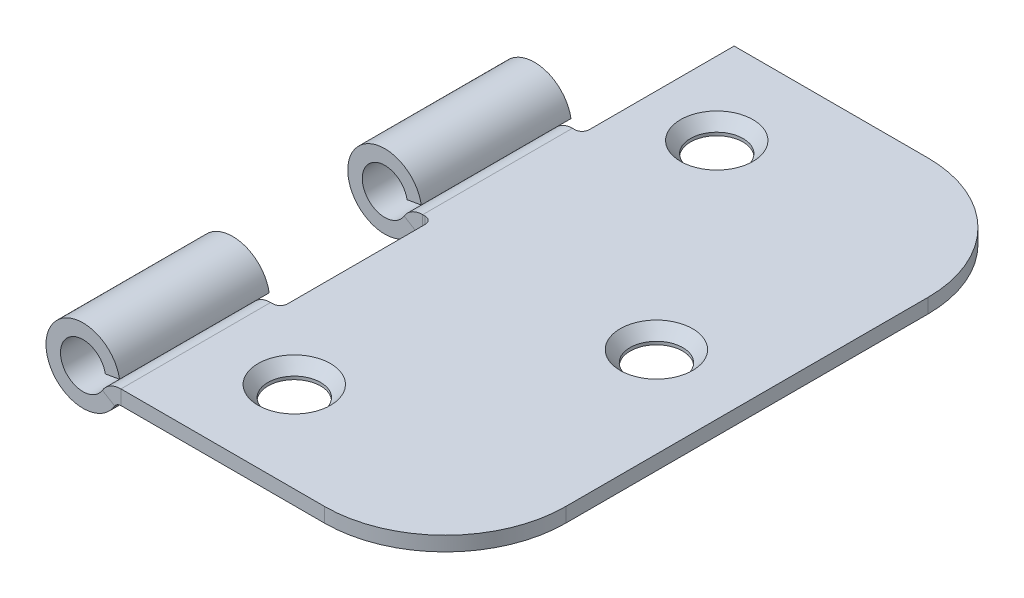
ISO-10303-21;
HEADER;
FILE_DESCRIPTION(('STEP AP214'),'2;1');
FILE_NAME('part.step','',(''),(''),'','','');
FILE_SCHEMA(('AUTOMOTIVE_DESIGN { 1 0 10303 214 1 1 1 1 }'));
ENDSEC;
DATA;
#1=APPLICATION_CONTEXT('core data for automotive mechanical design processes');
#2=APPLICATION_PROTOCOL_DEFINITION('international standard','automotive_design',2000,#1);
#3=PRODUCT_CONTEXT('',#1,'mechanical');
#4=PRODUCT('Part','Part','',(#3));
#5=PRODUCT_RELATED_PRODUCT_CATEGORY('part','',(#4));
#6=PRODUCT_DEFINITION_FORMATION('','',#4);
#7=PRODUCT_DEFINITION_CONTEXT('part definition',#1,'design');
#8=PRODUCT_DEFINITION('design','',#6,#7);
#9=PRODUCT_DEFINITION_SHAPE('','',#8);
#10=(LENGTH_UNIT() NAMED_UNIT(*) SI_UNIT(.MILLI.,.METRE.));
#11=(NAMED_UNIT(*) PLANE_ANGLE_UNIT() SI_UNIT($,.RADIAN.));
#12=(NAMED_UNIT(*) SI_UNIT($,.STERADIAN.) SOLID_ANGLE_UNIT());
#13=UNCERTAINTY_MEASURE_WITH_UNIT(LENGTH_MEASURE(1.E-05),#10,'distance_accuracy_value','');
#14=(GEOMETRIC_REPRESENTATION_CONTEXT(3) GLOBAL_UNCERTAINTY_ASSIGNED_CONTEXT((#13)) GLOBAL_UNIT_ASSIGNED_CONTEXT((#10,
#11,#12)) REPRESENTATION_CONTEXT('',''));
#15=CARTESIAN_POINT('',(0.,0.,0.));
#16=DIRECTION('',(0.,0.,1.));
#17=DIRECTION('',(1.,0.,0.));
#18=AXIS2_PLACEMENT_3D('',#15,#16,#17);
#19=CARTESIAN_POINT('',(-25.4,0.,-53.975));
#20=DIRECTION('',(0.,1.,0.));
#21=DIRECTION('',(0.,0.,1.));
#22=AXIS2_PLACEMENT_3D('',#19,#20,#21);
#23=CYLINDRICAL_SURFACE('',#22,2.7686);
#24=CARTESIAN_POINT('',(-25.4,-1.19799365927996,-53.975));
#25=DIRECTION('',(0.,1.,0.));
#26=DIRECTION('',(0.,0.,1.));
#27=AXIS2_PLACEMENT_3D('',#24,#25,#26);
#28=CIRCLE('',#27,2.7686);
#29=CARTESIAN_POINT('',(-25.4,-1.19799365927996,-51.2064));
#30=VERTEX_POINT('',#29);
#31=EDGE_CURVE('E366',#30,#30,#28,.T.);
#32=ORIENTED_EDGE('',*,*,#31,.T.);
#33=EDGE_LOOP('',(#32));
#34=FACE_BOUND('',#33,.T.);
#35=CARTESIAN_POINT('',(-25.4,-1.524,-53.975));
#36=DIRECTION('',(0.,-1.,0.));
#37=DIRECTION('',(1.,0.,0.));
#38=AXIS2_PLACEMENT_3D('',#35,#36,#37);
#39=CIRCLE('',#38,2.7686);
#40=CARTESIAN_POINT('',(-22.6314,-1.524,-53.975));
#41=VERTEX_POINT('',#40);
#42=EDGE_CURVE('E279',#41,#41,#39,.T.);
#43=ORIENTED_EDGE('',*,*,#42,.T.);
#44=EDGE_LOOP('',(#43));
#45=FACE_BOUND('',#44,.T.);
#46=ADVANCED_FACE('F34',(#34,#45),#23,.F.);
#47=CARTESIAN_POINT('',(-25.4,0.,-53.975));
#48=DIRECTION('',(0.,1.,0.));
#49=DIRECTION('',(0.,0.,1.));
#50=AXIS2_PLACEMENT_3D('',#47,#48,#49);
#51=CONICAL_SURFACE('',#50,3.81,0.715584993317676);
#52=ORIENTED_EDGE('',*,*,#31,.F.);
#53=EDGE_LOOP('',(#52));
#54=FACE_BOUND('',#53,.T.);
#55=CARTESIAN_POINT('',(-25.4,0.,-53.975));
#56=DIRECTION('',(0.,1.,0.));
#57=DIRECTION('',(0.,0.,1.));
#58=AXIS2_PLACEMENT_3D('',#55,#56,#57);
#59=CIRCLE('',#58,3.81);
#60=CARTESIAN_POINT('',(-25.4,0.,-50.165));
#61=VERTEX_POINT('',#60);
#62=EDGE_CURVE('E325',#61,#61,#59,.T.);
#63=ORIENTED_EDGE('',*,*,#62,.T.);
#64=EDGE_LOOP('',(#63));
#65=FACE_BOUND('',#64,.T.);
#66=ADVANCED_FACE('F487',(#54,#65),#51,.F.);
#67=CARTESIAN_POINT('',(-25.4,0.,-9.525));
#68=DIRECTION('',(0.,1.,0.));
#69=DIRECTION('',(0.,0.,1.));
#70=AXIS2_PLACEMENT_3D('',#67,#68,#69);
#71=CYLINDRICAL_SURFACE('',#70,2.7686);
#72=CARTESIAN_POINT('',(-25.4,-1.19799365927996,-9.525));
#73=DIRECTION('',(0.,1.,0.));
#74=DIRECTION('',(0.,0.,1.));
#75=AXIS2_PLACEMENT_3D('',#72,#73,#74);
#76=CIRCLE('',#75,2.7686);
#77=CARTESIAN_POINT('',(-25.4,-1.19799365927996,-6.7564));
#78=VERTEX_POINT('',#77);
#79=EDGE_CURVE('E363',#78,#78,#76,.T.);
#80=ORIENTED_EDGE('',*,*,#79,.T.);
#81=EDGE_LOOP('',(#80));
#82=FACE_BOUND('',#81,.T.);
#83=CARTESIAN_POINT('',(-25.4,-1.524,-9.525));
#84=DIRECTION('',(0.,-1.,0.));
#85=DIRECTION('',(1.,0.,0.));
#86=AXIS2_PLACEMENT_3D('',#83,#84,#85);
#87=CIRCLE('',#86,2.7686);
#88=CARTESIAN_POINT('',(-22.6314,-1.524,-9.525));
#89=VERTEX_POINT('',#88);
#90=EDGE_CURVE('E276',#89,#89,#87,.T.);
#91=ORIENTED_EDGE('',*,*,#90,.T.);
#92=EDGE_LOOP('',(#91));
#93=FACE_BOUND('',#92,.T.);
#94=ADVANCED_FACE('F493',(#82,#93),#71,.F.);
#95=CARTESIAN_POINT('',(-25.4,0.,-9.525));
#96=DIRECTION('',(0.,1.,0.));
#97=DIRECTION('',(0.,0.,1.));
#98=AXIS2_PLACEMENT_3D('',#95,#96,#97);
#99=CONICAL_SURFACE('',#98,3.81,0.715584993317676);
#100=ORIENTED_EDGE('',*,*,#79,.F.);
#101=EDGE_LOOP('',(#100));
#102=FACE_BOUND('',#101,.T.);
#103=CARTESIAN_POINT('',(-25.4,0.,-9.525));
#104=DIRECTION('',(0.,1.,0.));
#105=DIRECTION('',(0.,0.,1.));
#106=AXIS2_PLACEMENT_3D('',#103,#104,#105);
#107=CIRCLE('',#106,3.81);
#108=CARTESIAN_POINT('',(-25.4,0.,-5.715));
#109=VERTEX_POINT('',#108);
#110=EDGE_CURVE('E322',#109,#109,#107,.T.);
#111=ORIENTED_EDGE('',*,*,#110,.T.);
#112=EDGE_LOOP('',(#111));
#113=FACE_BOUND('',#112,.T.);
#114=ADVANCED_FACE('F585',(#102,#113),#99,.F.);
#115=CARTESIAN_POINT('',(-34.1123415630222,0.,-63.5));
#116=DIRECTION('',(0.,1.,0.));
#117=DIRECTION('',(0.,0.,1.));
#118=AXIS2_PLACEMENT_3D('',#115,#116,#117);
#119=PLANE('',#118);
#120=CARTESIAN_POINT('',(-9.525,0.,-31.75));
#121=DIRECTION('',(0.,1.,0.));
#122=DIRECTION('',(0.,0.,1.));
#123=AXIS2_PLACEMENT_3D('',#120,#121,#122);
#124=CIRCLE('',#123,3.81);
#125=CARTESIAN_POINT('',(-9.525,0.,-27.94));
#126=VERTEX_POINT('',#125);
#127=EDGE_CURVE('E319',#126,#126,#124,.T.);
#128=ORIENTED_EDGE('',*,*,#127,.F.);
#129=EDGE_LOOP('',(#128));
#130=FACE_BOUND('',#129,.T.);
#131=ORIENTED_EDGE('',*,*,#110,.F.);
#132=EDGE_LOOP('',(#131));
#133=FACE_BOUND('',#132,.T.);
#134=ORIENTED_EDGE('',*,*,#62,.F.);
#135=EDGE_LOOP('',(#134));
#136=FACE_BOUND('',#135,.T.);
#137=DIRECTION('',(0.,0.,1.));
#138=VECTOR('',#137,1.);
#139=CARTESIAN_POINT('',(0.,0.,-63.5));
#140=LINE('',#139,#138);
#141=CARTESIAN_POINT('',(0.,0.,-50.8));
#142=VERTEX_POINT('',#141);
#143=CARTESIAN_POINT('',(0.,0.,-12.7));
#144=VERTEX_POINT('',#143);
#145=EDGE_CURVE('E349',#142,#144,#140,.T.);
#146=ORIENTED_EDGE('',*,*,#145,.F.);
#147=CARTESIAN_POINT('',(-12.7,0.,-50.8));
#148=DIRECTION('',(0.,1.,0.));
#149=DIRECTION('',(0.,0.,1.));
#150=AXIS2_PLACEMENT_3D('',#147,#148,#149);
#151=CIRCLE('',#150,12.7);
#152=CARTESIAN_POINT('',(-12.7,0.,-63.5));
#153=VERTEX_POINT('',#152);
#154=EDGE_CURVE('E427',#142,#153,#151,.T.);
#155=ORIENTED_EDGE('',*,*,#154,.T.);
#156=DIRECTION('',(-1.,0.,0.));
#157=VECTOR('',#156,1.);
#158=CARTESIAN_POINT('',(-34.1123415630222,0.,-63.5));
#159=LINE('',#158,#157);
#160=CARTESIAN_POINT('',(-33.0963415630222,0.,-63.5));
#161=VERTEX_POINT('',#160);
#162=EDGE_CURVE('E352',#153,#161,#159,.T.);
#163=ORIENTED_EDGE('',*,*,#162,.T.);
#164=DIRECTION('',(0.,0.,-1.));
#165=VECTOR('',#164,1.);
#166=CARTESIAN_POINT('',(-33.0963415630222,0.,-63.5));
#167=LINE('',#166,#165);
#168=CARTESIAN_POINT('',(-33.0963415630222,0.,-48.26));
#169=VERTEX_POINT('',#168);
#170=EDGE_CURVE('E354',#169,#161,#167,.T.);
#171=ORIENTED_EDGE('',*,*,#170,.F.);
#172=CARTESIAN_POINT('',(-33.8583415630222,0.,-48.26));
#173=DIRECTION('',(0.,1.,0.));
#174=DIRECTION('',(0.,0.,1.));
#175=AXIS2_PLACEMENT_3D('',#172,#173,#174);
#176=CIRCLE('',#175,0.762000000000002);
#177=CARTESIAN_POINT('',(-33.8583415630222,0.,-47.498));
#178=VERTEX_POINT('',#177);
#179=EDGE_CURVE('E357',#178,#169,#176,.T.);
#180=ORIENTED_EDGE('',*,*,#179,.F.);
#181=DIRECTION('',(1.,0.,0.));
#182=VECTOR('',#181,1.);
#183=CARTESIAN_POINT('',(-34.1123415630222,0.,-47.498));
#184=LINE('',#183,#182);
#185=CARTESIAN_POINT('',(-34.1123415630222,0.,-47.498));
#186=VERTEX_POINT('',#185);
#187=EDGE_CURVE('E360',#186,#178,#184,.T.);
#188=ORIENTED_EDGE('',*,*,#187,.F.);
#189=DIRECTION('',(0.,0.,1.));
#190=VECTOR('',#189,1.);
#191=CARTESIAN_POINT('',(-34.1123415630222,0.,-63.5));
#192=LINE('',#191,#190);
#193=CARTESIAN_POINT('',(-34.1123415630222,0.,-31.75));
#194=VERTEX_POINT('',#193);
#195=EDGE_CURVE('E347',#186,#194,#192,.T.);
#196=ORIENTED_EDGE('',*,*,#195,.T.);
#197=DIRECTION('',(-1.,0.,0.));
#198=VECTOR('',#197,1.);
#199=CARTESIAN_POINT('',(-34.1123415630222,0.,-31.75));
#200=LINE('',#199,#198);
#201=CARTESIAN_POINT('',(-33.8583415630222,0.,-31.75));
#202=VERTEX_POINT('',#201);
#203=EDGE_CURVE('E328',#202,#194,#200,.T.);
#204=ORIENTED_EDGE('',*,*,#203,.F.);
#205=CARTESIAN_POINT('',(-33.8583415630222,0.,-30.988));
#206=DIRECTION('',(0.,1.,0.));
#207=DIRECTION('',(0.,0.,1.));
#208=AXIS2_PLACEMENT_3D('',#205,#206,#207);
#209=CIRCLE('',#208,0.761999999999995);
#210=CARTESIAN_POINT('',(-33.0963415630222,0.,-30.988));
#211=VERTEX_POINT('',#210);
#212=EDGE_CURVE('E331',#211,#202,#209,.T.);
#213=ORIENTED_EDGE('',*,*,#212,.F.);
#214=DIRECTION('',(0.,0.,-1.));
#215=VECTOR('',#214,1.);
#216=CARTESIAN_POINT('',(-33.0963415630222,0.,-63.5));
#217=LINE('',#216,#215);
#218=CARTESIAN_POINT('',(-33.0963415630222,0.,-16.51));
#219=VERTEX_POINT('',#218);
#220=EDGE_CURVE('E334',#219,#211,#217,.T.);
#221=ORIENTED_EDGE('',*,*,#220,.F.);
#222=CARTESIAN_POINT('',(-33.8583415630222,0.,-16.51));
#223=DIRECTION('',(0.,1.,0.));
#224=DIRECTION('',(0.,0.,1.));
#225=AXIS2_PLACEMENT_3D('',#222,#223,#224);
#226=CIRCLE('',#225,0.762000000000002);
#227=CARTESIAN_POINT('',(-33.8583415630222,0.,-15.748));
#228=VERTEX_POINT('',#227);
#229=EDGE_CURVE('E337',#228,#219,#226,.T.);
#230=ORIENTED_EDGE('',*,*,#229,.F.);
#231=DIRECTION('',(1.,0.,0.));
#232=VECTOR('',#231,1.);
#233=CARTESIAN_POINT('',(-34.1123415630222,0.,-15.748));
#234=LINE('',#233,#232);
#235=CARTESIAN_POINT('',(-34.1123415630222,0.,-15.748));
#236=VERTEX_POINT('',#235);
#237=EDGE_CURVE('E340',#236,#228,#234,.T.);
#238=ORIENTED_EDGE('',*,*,#237,.F.);
#239=CARTESIAN_POINT('',(-34.1123415630222,0.,0.));
#240=VERTEX_POINT('',#239);
#241=EDGE_CURVE('E343',#236,#240,#192,.T.);
#242=ORIENTED_EDGE('',*,*,#241,.T.);
#243=DIRECTION('',(-1.,0.,0.));
#244=VECTOR('',#243,1.);
#245=CARTESIAN_POINT('',(-34.1123415630222,0.,0.));
#246=LINE('',#245,#244);
#247=CARTESIAN_POINT('',(-12.7,0.,0.));
#248=VERTEX_POINT('',#247);
#249=EDGE_CURVE('E346',#248,#240,#246,.T.);
#250=ORIENTED_EDGE('',*,*,#249,.F.);
#251=CARTESIAN_POINT('',(-12.7,0.,-12.7));
#252=DIRECTION('',(0.,1.,0.));
#253=DIRECTION('',(0.,0.,1.));
#254=AXIS2_PLACEMENT_3D('',#251,#252,#253);
#255=CIRCLE('',#254,12.7);
#256=EDGE_CURVE('E425',#248,#144,#255,.T.);
#257=ORIENTED_EDGE('',*,*,#256,.T.);
#258=EDGE_LOOP('',(#146,#155,#163,#171,#180,#188,#196,#204,#213,#221,#230,#238,#242,#250,#257));
#259=FACE_BOUND('',#258,.T.);
#260=ADVANCED_FACE('F441',(#130,#133,#136,#259),#119,.T.);
#261=CARTESIAN_POINT('',(-9.525,0.,-31.75));
#262=DIRECTION('',(0.,1.,0.));
#263=DIRECTION('',(0.,0.,1.));
#264=AXIS2_PLACEMENT_3D('',#261,#262,#263);
#265=CONICAL_SURFACE('',#264,3.81,0.715584993317675);
#266=CARTESIAN_POINT('',(-9.525,-1.19799365927996,-31.75));
#267=DIRECTION('',(0.,1.,0.));
#268=DIRECTION('',(0.,0.,1.));
#269=AXIS2_PLACEMENT_3D('',#266,#267,#268);
#270=CIRCLE('',#269,2.7686);
#271=CARTESIAN_POINT('',(-9.525,-1.19799365927996,-28.9814));
#272=VERTEX_POINT('',#271);
#273=EDGE_CURVE('E316',#272,#272,#270,.T.);
#274=ORIENTED_EDGE('',*,*,#273,.F.);
#275=EDGE_LOOP('',(#274));
#276=FACE_BOUND('',#275,.T.);
#277=ORIENTED_EDGE('',*,*,#127,.T.);
#278=EDGE_LOOP('',(#277));
#279=FACE_BOUND('',#278,.T.);
#280=ADVANCED_FACE('F584',(#276,#279),#265,.F.);
#281=CARTESIAN_POINT('',(-9.525,0.,-31.75));
#282=DIRECTION('',(0.,1.,0.));
#283=DIRECTION('',(0.,0.,1.));
#284=AXIS2_PLACEMENT_3D('',#281,#282,#283);
#285=CYLINDRICAL_SURFACE('',#284,2.7686);
#286=ORIENTED_EDGE('',*,*,#273,.T.);
#287=EDGE_LOOP('',(#286));
#288=FACE_BOUND('',#287,.T.);
#289=CARTESIAN_POINT('',(-9.525,-1.524,-31.75));
#290=DIRECTION('',(0.,-1.,0.));
#291=DIRECTION('',(1.,0.,0.));
#292=AXIS2_PLACEMENT_3D('',#289,#290,#291);
#293=CIRCLE('',#292,2.7686);
#294=CARTESIAN_POINT('',(-6.7564,-1.524,-31.75));
#295=VERTEX_POINT('',#294);
#296=EDGE_CURVE('E269',#295,#295,#293,.T.);
#297=ORIENTED_EDGE('',*,*,#296,.T.);
#298=EDGE_LOOP('',(#297));
#299=FACE_BOUND('',#298,.T.);
#300=ADVANCED_FACE('F598',(#288,#299),#285,.F.);
#301=CARTESIAN_POINT('',(-34.1123415630222,-1.524,-63.5));
#302=DIRECTION('',(0.,-1.,0.));
#303=DIRECTION('',(1.,0.,0.));
#304=AXIS2_PLACEMENT_3D('',#301,#302,#303);
#305=PLANE('',#304);
#306=ORIENTED_EDGE('',*,*,#296,.F.);
#307=EDGE_LOOP('',(#306));
#308=FACE_BOUND('',#307,.T.);
#309=ORIENTED_EDGE('',*,*,#90,.F.);
#310=EDGE_LOOP('',(#309));
#311=FACE_BOUND('',#310,.T.);
#312=ORIENTED_EDGE('',*,*,#42,.F.);
#313=EDGE_LOOP('',(#312));
#314=FACE_BOUND('',#313,.T.);
#315=DIRECTION('',(1.,0.,0.));
#316=VECTOR('',#315,1.);
#317=CARTESIAN_POINT('',(-34.1123415630222,-1.524,-63.5));
#318=LINE('',#317,#316);
#319=CARTESIAN_POINT('',(-33.0963415630222,-1.524,-63.5));
#320=VERTEX_POINT('',#319);
#321=CARTESIAN_POINT('',(-12.7,-1.524,-63.5));
#322=VERTEX_POINT('',#321);
#323=EDGE_CURVE('E298',#320,#322,#318,.T.);
#324=ORIENTED_EDGE('',*,*,#323,.T.);
#325=CARTESIAN_POINT('',(-12.7,-1.524,-50.8));
#326=DIRECTION('',(0.,-1.,0.));
#327=DIRECTION('',(1.,0.,0.));
#328=AXIS2_PLACEMENT_3D('',#325,#326,#327);
#329=CIRCLE('',#328,12.7);
#330=CARTESIAN_POINT('',(0.,-1.524,-50.8));
#331=VERTEX_POINT('',#330);
#332=EDGE_CURVE('E42',#322,#331,#329,.T.);
#333=ORIENTED_EDGE('',*,*,#332,.T.);
#334=DIRECTION('',(0.,0.,1.));
#335=VECTOR('',#334,1.);
#336=CARTESIAN_POINT('',(0.,-1.524,-63.5));
#337=LINE('',#336,#335);
#338=CARTESIAN_POINT('',(0.,-1.524,-12.7));
#339=VERTEX_POINT('',#338);
#340=EDGE_CURVE('E300',#331,#339,#337,.T.);
#341=ORIENTED_EDGE('',*,*,#340,.T.);
#342=CARTESIAN_POINT('',(-12.7,-1.524,-12.7));
#343=DIRECTION('',(0.,-1.,0.));
#344=DIRECTION('',(1.,0.,0.));
#345=AXIS2_PLACEMENT_3D('',#342,#343,#344);
#346=CIRCLE('',#345,12.7);
#347=CARTESIAN_POINT('',(-12.7,-1.524,0.));
#348=VERTEX_POINT('',#347);
#349=EDGE_CURVE('E49',#339,#348,#346,.T.);
#350=ORIENTED_EDGE('',*,*,#349,.T.);
#351=DIRECTION('',(1.,0.,0.));
#352=VECTOR('',#351,1.);
#353=CARTESIAN_POINT('',(-34.1123415630222,-1.524,0.));
#354=LINE('',#353,#352);
#355=CARTESIAN_POINT('',(-34.1123415630222,-1.524,0.));
#356=VERTEX_POINT('',#355);
#357=EDGE_CURVE('E302',#356,#348,#354,.T.);
#358=ORIENTED_EDGE('',*,*,#357,.F.);
#359=DIRECTION('',(0.,0.,1.));
#360=VECTOR('',#359,1.);
#361=CARTESIAN_POINT('',(-34.1123415630222,-1.524,-63.5));
#362=LINE('',#361,#360);
#363=CARTESIAN_POINT('',(-34.1123415630222,-1.524,-15.748));
#364=VERTEX_POINT('',#363);
#365=EDGE_CURVE('E289',#364,#356,#362,.T.);
#366=ORIENTED_EDGE('',*,*,#365,.F.);
#367=DIRECTION('',(-1.,0.,0.));
#368=VECTOR('',#367,1.);
#369=CARTESIAN_POINT('',(-34.1123415630222,-1.524,-15.748));
#370=LINE('',#369,#368);
#371=CARTESIAN_POINT('',(-33.8583415630222,-1.524,-15.748));
#372=VERTEX_POINT('',#371);
#373=EDGE_CURVE('E304',#372,#364,#370,.T.);
#374=ORIENTED_EDGE('',*,*,#373,.F.);
#375=CARTESIAN_POINT('',(-33.8583415630222,-1.524,-16.51));
#376=DIRECTION('',(0.,-1.,0.));
#377=DIRECTION('',(1.,0.,0.));
#378=AXIS2_PLACEMENT_3D('',#375,#376,#377);
#379=CIRCLE('',#378,0.762000000000002);
#380=CARTESIAN_POINT('',(-33.0963415630222,-1.524,-16.51));
#381=VERTEX_POINT('',#380);
#382=EDGE_CURVE('E307',#381,#372,#379,.T.);
#383=ORIENTED_EDGE('',*,*,#382,.F.);
#384=DIRECTION('',(0.,0.,1.));
#385=VECTOR('',#384,1.);
#386=CARTESIAN_POINT('',(-33.0963415630222,-1.524,-63.5));
#387=LINE('',#386,#385);
#388=CARTESIAN_POINT('',(-33.0963415630222,-1.524,-30.988));
#389=VERTEX_POINT('',#388);
#390=EDGE_CURVE('E310',#389,#381,#387,.T.);
#391=ORIENTED_EDGE('',*,*,#390,.F.);
#392=CARTESIAN_POINT('',(-33.8583415630222,-1.524,-30.988));
#393=DIRECTION('',(0.,-1.,0.));
#394=DIRECTION('',(1.,0.,0.));
#395=AXIS2_PLACEMENT_3D('',#392,#393,#394);
#396=CIRCLE('',#395,0.761999999999995);
#397=CARTESIAN_POINT('',(-33.8583415630222,-1.524,-31.75));
#398=VERTEX_POINT('',#397);
#399=EDGE_CURVE('E313',#398,#389,#396,.T.);
#400=ORIENTED_EDGE('',*,*,#399,.F.);
#401=DIRECTION('',(1.,0.,0.));
#402=VECTOR('',#401,1.);
#403=CARTESIAN_POINT('',(-34.1123415630222,-1.524,-31.75));
#404=LINE('',#403,#402);
#405=CARTESIAN_POINT('',(-34.1123415630222,-1.524,-31.75));
#406=VERTEX_POINT('',#405);
#407=EDGE_CURVE('E282',#406,#398,#404,.T.);
#408=ORIENTED_EDGE('',*,*,#407,.F.);
#409=CARTESIAN_POINT('',(-34.1123415630222,-1.524,-47.498));
#410=VERTEX_POINT('',#409);
#411=EDGE_CURVE('E285',#410,#406,#362,.T.);
#412=ORIENTED_EDGE('',*,*,#411,.F.);
#413=DIRECTION('',(-1.,0.,0.));
#414=VECTOR('',#413,1.);
#415=CARTESIAN_POINT('',(-34.1123415630222,-1.524,-47.498));
#416=LINE('',#415,#414);
#417=CARTESIAN_POINT('',(-33.8583415630222,-1.524,-47.498));
#418=VERTEX_POINT('',#417);
#419=EDGE_CURVE('E288',#418,#410,#416,.T.);
#420=ORIENTED_EDGE('',*,*,#419,.F.);
#421=CARTESIAN_POINT('',(-33.8583415630222,-1.524,-48.26));
#422=DIRECTION('',(0.,-1.,0.));
#423=DIRECTION('',(1.,0.,0.));
#424=AXIS2_PLACEMENT_3D('',#421,#422,#423);
#425=CIRCLE('',#424,0.762000000000002);
#426=CARTESIAN_POINT('',(-33.0963415630222,-1.524,-48.26));
#427=VERTEX_POINT('',#426);
#428=EDGE_CURVE('E292',#427,#418,#425,.T.);
#429=ORIENTED_EDGE('',*,*,#428,.F.);
#430=DIRECTION('',(0.,0.,1.));
#431=VECTOR('',#430,1.);
#432=CARTESIAN_POINT('',(-33.0963415630222,-1.524,-63.5));
#433=LINE('',#432,#431);
#434=EDGE_CURVE('E295',#320,#427,#433,.T.);
#435=ORIENTED_EDGE('',*,*,#434,.F.);
#436=EDGE_LOOP('',(#324,#333,#341,#350,#358,#366,#374,#383,#391,#400,#408,#412,#420,#429,#435));
#437=FACE_BOUND('',#436,.T.);
#438=ADVANCED_FACE('F432',(#308,#311,#314,#437),#305,.T.);
#439=CARTESIAN_POINT('',(-34.1123415630222,-144.165208658848,-31.75));
#440=DIRECTION('',(0.,0.,1.));
#441=DIRECTION('',(1.,0.,0.));
#442=AXIS2_PLACEMENT_3D('',#439,#440,#441);
#443=PLANE('',#442);
#444=DIRECTION('',(0.,1.,0.));
#445=VECTOR('',#444,1.);
#446=CARTESIAN_POINT('',(-33.8583415630222,-144.165208658848,-31.75));
#447=LINE('',#446,#445);
#448=EDGE_CURVE('E369',#398,#202,#447,.T.);
#449=ORIENTED_EDGE('',*,*,#448,.T.);
#450=ORIENTED_EDGE('',*,*,#203,.T.);
#451=DIRECTION('',(0.,1.,0.));
#452=VECTOR('',#451,1.);
#453=CARTESIAN_POINT('',(-34.1123415630222,-144.165208658848,-31.75));
#454=LINE('',#453,#452);
#455=EDGE_CURVE('E399',#406,#194,#454,.T.);
#456=ORIENTED_EDGE('',*,*,#455,.F.);
#457=ORIENTED_EDGE('',*,*,#407,.T.);
#458=EDGE_LOOP('',(#449,#450,#456,#457));
#459=FACE_BOUND('',#458,.T.);
#460=ADVANCED_FACE('F457',(#459),#443,.T.);
#461=CARTESIAN_POINT('',(-34.1123415630222,-144.165208658848,-47.498));
#462=DIRECTION('',(0.,0.,-1.));
#463=DIRECTION('',(-1.,0.,0.));
#464=AXIS2_PLACEMENT_3D('',#461,#462,#463);
#465=PLANE('',#464);
#466=DIRECTION('',(0.,1.,0.));
#467=VECTOR('',#466,1.);
#468=CARTESIAN_POINT('',(-34.1123415630222,-144.165208658848,-47.498));
#469=LINE('',#468,#467);
#470=EDGE_CURVE('E396',#410,#186,#469,.T.);
#471=ORIENTED_EDGE('',*,*,#470,.T.);
#472=ORIENTED_EDGE('',*,*,#187,.T.);
#473=DIRECTION('',(0.,1.,0.));
#474=VECTOR('',#473,1.);
#475=CARTESIAN_POINT('',(-33.8583415630222,-144.165208658848,-47.498));
#476=LINE('',#475,#474);
#477=EDGE_CURVE('E393',#418,#178,#476,.T.);
#478=ORIENTED_EDGE('',*,*,#477,.F.);
#479=ORIENTED_EDGE('',*,*,#419,.T.);
#480=EDGE_LOOP('',(#471,#472,#478,#479));
#481=FACE_BOUND('',#480,.T.);
#482=ADVANCED_FACE('F451',(#481),#465,.T.);
#483=CARTESIAN_POINT('',(-33.8583415630222,-144.165208658848,-48.26));
#484=DIRECTION('',(0.,1.,0.));
#485=DIRECTION('',(-1.,0.,0.));
#486=AXIS2_PLACEMENT_3D('',#483,#484,#485);
#487=CYLINDRICAL_SURFACE('',#486,0.762000000000002);
#488=ORIENTED_EDGE('',*,*,#477,.T.);
#489=ORIENTED_EDGE('',*,*,#179,.T.);
#490=DIRECTION('',(0.,1.,0.));
#491=VECTOR('',#490,1.);
#492=CARTESIAN_POINT('',(-33.0963415630222,-144.165208658848,-48.26));
#493=LINE('',#492,#491);
#494=EDGE_CURVE('E390',#427,#169,#493,.T.);
#495=ORIENTED_EDGE('',*,*,#494,.F.);
#496=ORIENTED_EDGE('',*,*,#428,.T.);
#497=EDGE_LOOP('',(#488,#489,#495,#496));
#498=FACE_BOUND('',#497,.T.);
#499=ADVANCED_FACE('F448',(#498),#487,.F.);
#500=CARTESIAN_POINT('',(-33.0963415630222,-144.165208658848,-63.5));
#501=DIRECTION('',(-1.,0.,0.));
#502=DIRECTION('',(0.,-1.,0.));
#503=AXIS2_PLACEMENT_3D('',#500,#501,#502);
#504=PLANE('',#503);
#505=ORIENTED_EDGE('',*,*,#494,.T.);
#506=ORIENTED_EDGE('',*,*,#170,.T.);
#507=DIRECTION('',(0.,1.,0.));
#508=VECTOR('',#507,1.);
#509=CARTESIAN_POINT('',(-33.0963415630222,-144.165208658848,-63.5));
#510=LINE('',#509,#508);
#511=EDGE_CURVE('E387',#320,#161,#510,.T.);
#512=ORIENTED_EDGE('',*,*,#511,.F.);
#513=ORIENTED_EDGE('',*,*,#434,.T.);
#514=EDGE_LOOP('',(#505,#506,#512,#513));
#515=FACE_BOUND('',#514,.T.);
#516=ADVANCED_FACE('F445',(#515),#504,.T.);
#517=CARTESIAN_POINT('',(-34.1123415630222,-144.165208658848,-63.5));
#518=DIRECTION('',(0.,0.,1.));
#519=DIRECTION('',(1.,0.,0.));
#520=AXIS2_PLACEMENT_3D('',#517,#518,#519);
#521=PLANE('',#520);
#522=ORIENTED_EDGE('',*,*,#162,.F.);
#523=DIRECTION('',(0.,1.,0.));
#524=VECTOR('',#523,1.);
#525=CARTESIAN_POINT('',(-12.7,-144.165208658848,-63.5));
#526=LINE('',#525,#524);
#527=EDGE_CURVE('E57',#153,#322,#526,.F.);
#528=ORIENTED_EDGE('',*,*,#527,.T.);
#529=ORIENTED_EDGE('',*,*,#323,.F.);
#530=ORIENTED_EDGE('',*,*,#511,.T.);
#531=EDGE_LOOP('',(#522,#528,#529,#530));
#532=FACE_BOUND('',#531,.T.);
#533=ADVANCED_FACE('F442',(#532),#521,.F.);
#534=CARTESIAN_POINT('',(0.,-144.165208658848,-63.5));
#535=DIRECTION('',(-1.,0.,0.));
#536=DIRECTION('',(0.,-1.,0.));
#537=AXIS2_PLACEMENT_3D('',#534,#535,#536);
#538=PLANE('',#537);
#539=ORIENTED_EDGE('',*,*,#340,.F.);
#540=DIRECTION('',(0.,1.,0.));
#541=VECTOR('',#540,1.);
#542=CARTESIAN_POINT('',(0.,-144.165208658848,-50.8));
#543=LINE('',#542,#541);
#544=EDGE_CURVE('E422',#331,#142,#543,.T.);
#545=ORIENTED_EDGE('',*,*,#544,.T.);
#546=ORIENTED_EDGE('',*,*,#145,.T.);
#547=DIRECTION('',(0.,1.,0.));
#548=VECTOR('',#547,1.);
#549=CARTESIAN_POINT('',(0.,-1.524,-12.7));
#550=LINE('',#549,#548);
#551=EDGE_CURVE('E414',#144,#339,#550,.F.);
#552=ORIENTED_EDGE('',*,*,#551,.T.);
#553=EDGE_LOOP('',(#539,#545,#546,#552));
#554=FACE_BOUND('',#553,.T.);
#555=ADVANCED_FACE('F436',(#554),#538,.F.);
#556=CARTESIAN_POINT('',(-34.1123415630222,-144.165208658848,0.));
#557=DIRECTION('',(0.,0.,1.));
#558=DIRECTION('',(1.,0.,0.));
#559=AXIS2_PLACEMENT_3D('',#556,#557,#558);
#560=PLANE('',#559);
#561=ORIENTED_EDGE('',*,*,#357,.T.);
#562=DIRECTION('',(0.,1.,0.));
#563=VECTOR('',#562,1.);
#564=CARTESIAN_POINT('',(-12.7,0.,0.));
#565=LINE('',#564,#563);
#566=EDGE_CURVE('E11',#348,#248,#565,.T.);
#567=ORIENTED_EDGE('',*,*,#566,.T.);
#568=ORIENTED_EDGE('',*,*,#249,.T.);
#569=DIRECTION('',(0.,1.,0.));
#570=VECTOR('',#569,1.);
#571=CARTESIAN_POINT('',(-34.1123415630222,-144.165208658848,0.));
#572=LINE('',#571,#570);
#573=EDGE_CURVE('E384',#356,#240,#572,.T.);
#574=ORIENTED_EDGE('',*,*,#573,.F.);
#575=EDGE_LOOP('',(#561,#567,#568,#574));
#576=FACE_BOUND('',#575,.T.);
#577=ADVANCED_FACE('F515',(#576),#560,.T.);
#578=CARTESIAN_POINT('',(-34.1123415630222,-144.165208658848,-15.748));
#579=DIRECTION('',(0.,0.,-1.));
#580=DIRECTION('',(-1.,0.,0.));
#581=AXIS2_PLACEMENT_3D('',#578,#579,#580);
#582=PLANE('',#581);
#583=DIRECTION('',(0.,1.,0.));
#584=VECTOR('',#583,1.);
#585=CARTESIAN_POINT('',(-34.1123415630222,-144.165208658848,-15.748));
#586=LINE('',#585,#584);
#587=EDGE_CURVE('E381',#364,#236,#586,.T.);
#588=ORIENTED_EDGE('',*,*,#587,.T.);
#589=ORIENTED_EDGE('',*,*,#237,.T.);
#590=DIRECTION('',(0.,1.,0.));
#591=VECTOR('',#590,1.);
#592=CARTESIAN_POINT('',(-33.8583415630222,-144.165208658848,-15.748));
#593=LINE('',#592,#591);
#594=EDGE_CURVE('E378',#372,#228,#593,.T.);
#595=ORIENTED_EDGE('',*,*,#594,.F.);
#596=ORIENTED_EDGE('',*,*,#373,.T.);
#597=EDGE_LOOP('',(#588,#589,#595,#596));
#598=FACE_BOUND('',#597,.T.);
#599=ADVANCED_FACE('F511',(#598),#582,.T.);
#600=CARTESIAN_POINT('',(-33.8583415630222,-144.165208658848,-16.51));
#601=DIRECTION('',(0.,1.,0.));
#602=DIRECTION('',(-1.,0.,0.));
#603=AXIS2_PLACEMENT_3D('',#600,#601,#602);
#604=CYLINDRICAL_SURFACE('',#603,0.762000000000002);
#605=ORIENTED_EDGE('',*,*,#594,.T.);
#606=ORIENTED_EDGE('',*,*,#229,.T.);
#607=DIRECTION('',(0.,1.,0.));
#608=VECTOR('',#607,1.);
#609=CARTESIAN_POINT('',(-33.0963415630222,-144.165208658848,-16.51));
#610=LINE('',#609,#608);
#611=EDGE_CURVE('E375',#381,#219,#610,.T.);
#612=ORIENTED_EDGE('',*,*,#611,.F.);
#613=ORIENTED_EDGE('',*,*,#382,.T.);
#614=EDGE_LOOP('',(#605,#606,#612,#613));
#615=FACE_BOUND('',#614,.T.);
#616=ADVANCED_FACE('F507',(#615),#604,.F.);
#617=CARTESIAN_POINT('',(-33.0963415630222,-144.165208658848,-63.5));
#618=DIRECTION('',(-1.,0.,0.));
#619=DIRECTION('',(0.,0.,1.));
#620=AXIS2_PLACEMENT_3D('',#617,#618,#619);
#621=PLANE('',#620);
#622=ORIENTED_EDGE('',*,*,#611,.T.);
#623=ORIENTED_EDGE('',*,*,#220,.T.);
#624=DIRECTION('',(0.,1.,0.));
#625=VECTOR('',#624,1.);
#626=CARTESIAN_POINT('',(-33.0963415630222,-144.165208658848,-30.988));
#627=LINE('',#626,#625);
#628=EDGE_CURVE('E372',#389,#211,#627,.T.);
#629=ORIENTED_EDGE('',*,*,#628,.F.);
#630=ORIENTED_EDGE('',*,*,#390,.T.);
#631=EDGE_LOOP('',(#622,#623,#629,#630));
#632=FACE_BOUND('',#631,.T.);
#633=ADVANCED_FACE('F503',(#632),#621,.T.);
#634=CARTESIAN_POINT('',(-33.8583415630222,-144.165208658848,-30.988));
#635=DIRECTION('',(0.,1.,0.));
#636=DIRECTION('',(-1.,0.,0.));
#637=AXIS2_PLACEMENT_3D('',#634,#635,#636);
#638=CYLINDRICAL_SURFACE('',#637,0.761999999999995);
#639=ORIENTED_EDGE('',*,*,#628,.T.);
#640=ORIENTED_EDGE('',*,*,#212,.T.);
#641=ORIENTED_EDGE('',*,*,#448,.F.);
#642=ORIENTED_EDGE('',*,*,#399,.T.);
#643=EDGE_LOOP('',(#639,#640,#641,#642));
#644=FACE_BOUND('',#643,.T.);
#645=ADVANCED_FACE('F499',(#644),#638,.F.);
#646=CARTESIAN_POINT('',(-34.1123415630222,-2.28599999999999,0.));
#647=DIRECTION('',(0.,0.,1.));
#648=DIRECTION('',(1.,0.,0.));
#649=AXIS2_PLACEMENT_3D('',#646,#647,#648);
#650=PLANE('',#649);
#651=DIRECTION('',(-0.855555458597648,0.517711171662124,0.));
#652=VECTOR('',#651,1.);
#653=CARTESIAN_POINT('',(-34.7642748224736,-1.89150408719345,0.));
#654=LINE('',#653,#652);
#655=CARTESIAN_POINT('',(-34.7642748224736,-1.89150408719344,0.));
#656=VERTEX_POINT('',#655);
#657=CARTESIAN_POINT('',(-36.0681413413765,-1.10251226158037,0.));
#658=VERTEX_POINT('',#657);
#659=EDGE_CURVE('E406',#656,#658,#654,.T.);
#660=ORIENTED_EDGE('',*,*,#659,.F.);
#661=CARTESIAN_POINT('',(-34.1123415630222,-2.28599999999999,0.));
#662=DIRECTION('',(0.,0.,-1.));
#663=DIRECTION('',(0.,1.,0.));
#664=AXIS2_PLACEMENT_3D('',#661,#662,#663);
#665=CIRCLE('',#664,0.761999999999995);
#666=EDGE_CURVE('E261',#656,#356,#665,.T.);
#667=ORIENTED_EDGE('',*,*,#666,.T.);
#668=ORIENTED_EDGE('',*,*,#573,.T.);
#669=CARTESIAN_POINT('',(-34.1123415630222,-2.28599999999999,0.));
#670=DIRECTION('',(0.,0.,-1.));
#671=DIRECTION('',(0.,1.,0.));
#672=AXIS2_PLACEMENT_3D('',#669,#670,#671);
#673=CIRCLE('',#672,2.286);
#674=EDGE_CURVE('E262',#658,#240,#673,.T.);
#675=ORIENTED_EDGE('',*,*,#674,.F.);
#676=EDGE_LOOP('',(#660,#667,#668,#675));
#677=FACE_BOUND('',#676,.T.);
#678=ADVANCED_FACE('F502',(#677),#650,.T.);
#679=CARTESIAN_POINT('',(-34.1123415630222,-2.286,-15.748));
#680=DIRECTION('',(0.,0.,-1.));
#681=DIRECTION('',(0.,1.,0.));
#682=AXIS2_PLACEMENT_3D('',#679,#680,#681);
#683=PLANE('',#682);
#684=CARTESIAN_POINT('',(-34.1123415630222,-2.286,-15.748));
#685=DIRECTION('',(0.,0.,-1.));
#686=DIRECTION('',(0.,1.,0.));
#687=AXIS2_PLACEMENT_3D('',#684,#685,#686);
#688=CIRCLE('',#687,0.761999999999995);
#689=CARTESIAN_POINT('',(-34.7642748224737,-1.89150408719346,-15.748));
#690=VERTEX_POINT('',#689);
#691=EDGE_CURVE('E266',#364,#690,#688,.F.);
#692=ORIENTED_EDGE('',*,*,#691,.T.);
#693=DIRECTION('',(-0.855555458597648,0.517711171662124,0.));
#694=VECTOR('',#693,1.);
#695=CARTESIAN_POINT('',(-34.7642748224737,-1.89150408719346,-15.748));
#696=LINE('',#695,#694);
#697=CARTESIAN_POINT('',(-36.0681413413765,-1.10251226158038,-15.748));
#698=VERTEX_POINT('',#697);
#699=EDGE_CURVE('E402',#690,#698,#696,.T.);
#700=ORIENTED_EDGE('',*,*,#699,.T.);
#701=CARTESIAN_POINT('',(-34.1123415630222,-2.286,-15.748));
#702=DIRECTION('',(0.,0.,-1.));
#703=DIRECTION('',(0.,1.,0.));
#704=AXIS2_PLACEMENT_3D('',#701,#702,#703);
#705=CIRCLE('',#704,2.286);
#706=EDGE_CURVE('E265',#236,#698,#705,.F.);
#707=ORIENTED_EDGE('',*,*,#706,.F.);
#708=ORIENTED_EDGE('',*,*,#587,.F.);
#709=EDGE_LOOP('',(#692,#700,#707,#708));
#710=FACE_BOUND('',#709,.T.);
#711=ADVANCED_FACE('F654',(#710),#683,.T.);
#712=CARTESIAN_POINT('',(-34.1123415630222,-2.28599999999996,82.2973196010219));
#713=DIRECTION('',(0.,0.,-1.));
#714=DIRECTION('',(0.,1.,0.));
#715=AXIS2_PLACEMENT_3D('',#712,#713,#714);
#716=CYLINDRICAL_SURFACE('',#715,2.286);
#717=ORIENTED_EDGE('',*,*,#241,.F.);
#718=ORIENTED_EDGE('',*,*,#706,.T.);
#719=DIRECTION('',(0.,0.,1.));
#720=VECTOR('',#719,1.);
#721=CARTESIAN_POINT('',(-36.0681413413765,-1.10251226158038,-15.748));
#722=LINE('',#721,#720);
#723=EDGE_CURVE('E409',#698,#658,#722,.T.);
#724=ORIENTED_EDGE('',*,*,#723,.T.);
#725=ORIENTED_EDGE('',*,*,#674,.T.);
#726=EDGE_LOOP('',(#717,#718,#724,#725));
#727=FACE_BOUND('',#726,.T.);
#728=ADVANCED_FACE('F662',(#727),#716,.T.);
#729=CARTESIAN_POINT('',(-34.1123415630222,-2.28599999999996,82.2973196010219));
#730=DIRECTION('',(0.,0.,-1.));
#731=DIRECTION('',(0.,1.,0.));
#732=AXIS2_PLACEMENT_3D('',#729,#730,#731);
#733=CYLINDRICAL_SURFACE('',#732,0.761999999999995);
#734=ORIENTED_EDGE('',*,*,#365,.T.);
#735=ORIENTED_EDGE('',*,*,#666,.F.);
#736=DIRECTION('',(0.,0.,1.));
#737=VECTOR('',#736,1.);
#738=CARTESIAN_POINT('',(-34.7642748224737,-1.89150408719346,-15.748));
#739=LINE('',#738,#737);
#740=EDGE_CURVE('E403',#690,#656,#739,.T.);
#741=ORIENTED_EDGE('',*,*,#740,.F.);
#742=ORIENTED_EDGE('',*,*,#691,.F.);
#743=EDGE_LOOP('',(#734,#735,#741,#742));
#744=FACE_BOUND('',#743,.T.);
#745=ADVANCED_FACE('F670',(#744),#733,.F.);
#746=CARTESIAN_POINT('',(-38.1,0.127,0.));
#747=DIRECTION('',(0.,0.,1.));
#748=DIRECTION('',(0.,-1.,0.));
#749=AXIS2_PLACEMENT_3D('',#746,#747,#748);
#750=PLANE('',#749);
#751=ORIENTED_EDGE('',*,*,#659,.T.);
#752=CARTESIAN_POINT('',(-38.1,0.127,0.));
#753=DIRECTION('',(0.,0.,1.));
#754=DIRECTION('',(1.,0.,0.));
#755=AXIS2_PLACEMENT_3D('',#752,#753,#754);
#756=CIRCLE('',#755,2.3749);
#757=CARTESIAN_POINT('',(-35.7611800673713,0.53939705714116,0.));
#758=VERTEX_POINT('',#757);
#759=EDGE_CURVE('E244',#658,#758,#756,.F.);
#760=ORIENTED_EDGE('',*,*,#759,.T.);
#761=DIRECTION('',(0.98480775301221,0.173648177666917,0.));
#762=VECTOR('',#761,1.);
#763=CARTESIAN_POINT('',(-35.1308243208233,0.650545782702201,0.));
#764=LINE('',#763,#762);
#765=CARTESIAN_POINT('',(-34.2603330517807,0.804036879905541,0.));
#766=VERTEX_POINT('',#765);
#767=EDGE_CURVE('E259',#758,#766,#764,.T.);
#768=ORIENTED_EDGE('',*,*,#767,.T.);
#769=CARTESIAN_POINT('',(-38.1,0.127,0.));
#770=DIRECTION('',(0.,0.,1.));
#771=DIRECTION('',(1.,0.,0.));
#772=AXIS2_PLACEMENT_3D('',#769,#770,#771);
#773=CIRCLE('',#772,3.8989);
#774=EDGE_CURVE('E247',#656,#766,#773,.F.);
#775=ORIENTED_EDGE('',*,*,#774,.F.);
#776=EDGE_LOOP('',(#751,#760,#768,#775));
#777=FACE_BOUND('',#776,.T.);
#778=ADVANCED_FACE('F678',(#777),#750,.T.);
#779=CARTESIAN_POINT('',(-35.1308243208233,0.650545782702206,-7.874));
#780=DIRECTION('',(0.173648177666919,-0.98480775301221,0.));
#781=DIRECTION('',(0.,0.,-1.));
#782=AXIS2_PLACEMENT_3D('',#779,#780,#781);
#783=PLANE('',#782);
#784=ORIENTED_EDGE('',*,*,#767,.F.);
#785=DIRECTION('',(0.,0.,1.));
#786=VECTOR('',#785,1.);
#787=CARTESIAN_POINT('',(-35.7611800673713,0.539397057141165,-99.619482803377));
#788=LINE('',#787,#786);
#789=CARTESIAN_POINT('',(-35.7611800673713,0.539397057141168,-15.748));
#790=VERTEX_POINT('',#789);
#791=EDGE_CURVE('E253',#758,#790,#788,.F.);
#792=ORIENTED_EDGE('',*,*,#791,.T.);
#793=DIRECTION('',(0.98480775301221,0.17364817766692,0.));
#794=VECTOR('',#793,1.);
#795=CARTESIAN_POINT('',(-35.1308243208233,0.65054578270221,-15.748));
#796=LINE('',#795,#794);
#797=CARTESIAN_POINT('',(-34.2603330517807,0.804036879905554,-15.748));
#798=VERTEX_POINT('',#797);
#799=EDGE_CURVE('E250',#790,#798,#796,.T.);
#800=ORIENTED_EDGE('',*,*,#799,.T.);
#801=DIRECTION('',(0.,0.,1.));
#802=VECTOR('',#801,1.);
#803=CARTESIAN_POINT('',(-34.2603330517807,0.804036879905549,-99.619482803377));
#804=LINE('',#803,#802);
#805=EDGE_CURVE('E243',#766,#798,#804,.F.);
#806=ORIENTED_EDGE('',*,*,#805,.F.);
#807=EDGE_LOOP('',(#784,#792,#800,#806));
#808=FACE_BOUND('',#807,.T.);
#809=ADVANCED_FACE('F686',(#808),#783,.T.);
#810=CARTESIAN_POINT('',(-38.1,0.127,-15.748));
#811=DIRECTION('',(0.,0.,-1.));
#812=DIRECTION('',(0.,1.,0.));
#813=AXIS2_PLACEMENT_3D('',#810,#811,#812);
#814=PLANE('',#813);
#815=ORIENTED_EDGE('',*,*,#799,.F.);
#816=CARTESIAN_POINT('',(-38.1,0.127,-15.748));
#817=DIRECTION('',(0.,0.,1.));
#818=DIRECTION('',(1.,0.,0.));
#819=AXIS2_PLACEMENT_3D('',#816,#817,#818);
#820=CIRCLE('',#819,2.3749);
#821=EDGE_CURVE('E235',#790,#698,#820,.T.);
#822=ORIENTED_EDGE('',*,*,#821,.T.);
#823=ORIENTED_EDGE('',*,*,#699,.F.);
#824=CARTESIAN_POINT('',(-38.1,0.127,-15.748));
#825=DIRECTION('',(0.,0.,1.));
#826=DIRECTION('',(1.,0.,0.));
#827=AXIS2_PLACEMENT_3D('',#824,#825,#826);
#828=CIRCLE('',#827,3.8989);
#829=EDGE_CURVE('E240',#798,#690,#828,.T.);
#830=ORIENTED_EDGE('',*,*,#829,.F.);
#831=EDGE_LOOP('',(#815,#822,#823,#830));
#832=FACE_BOUND('',#831,.T.);
#833=ADVANCED_FACE('F694',(#832),#814,.T.);
#834=CARTESIAN_POINT('',(-38.1,0.127,-99.619482803377));
#835=DIRECTION('',(0.,0.,1.));
#836=DIRECTION('',(1.,0.,0.));
#837=AXIS2_PLACEMENT_3D('',#834,#835,#836);
#838=CYLINDRICAL_SURFACE('',#837,3.8989);
#839=ORIENTED_EDGE('',*,*,#829,.T.);
#840=ORIENTED_EDGE('',*,*,#740,.T.);
#841=ORIENTED_EDGE('',*,*,#774,.T.);
#842=ORIENTED_EDGE('',*,*,#805,.T.);
#843=EDGE_LOOP('',(#839,#840,#841,#842));
#844=FACE_BOUND('',#843,.T.);
#845=ADVANCED_FACE('F702',(#844),#838,.T.);
#846=CARTESIAN_POINT('',(-38.1,0.127,-99.619482803377));
#847=DIRECTION('',(0.,0.,1.));
#848=DIRECTION('',(1.,0.,0.));
#849=AXIS2_PLACEMENT_3D('',#846,#847,#848);
#850=CYLINDRICAL_SURFACE('',#849,2.3749);
#851=ORIENTED_EDGE('',*,*,#821,.F.);
#852=ORIENTED_EDGE('',*,*,#791,.F.);
#853=ORIENTED_EDGE('',*,*,#759,.F.);
#854=ORIENTED_EDGE('',*,*,#723,.F.);
#855=EDGE_LOOP('',(#851,#852,#853,#854));
#856=FACE_BOUND('',#855,.T.);
#857=ADVANCED_FACE('F483',(#856),#850,.F.);
#858=CARTESIAN_POINT('',(-34.1123415630222,-2.286,-31.75));
#859=DIRECTION('',(0.,0.,1.));
#860=DIRECTION('',(0.,-1.,0.));
#861=AXIS2_PLACEMENT_3D('',#858,#859,#860);
#862=PLANE('',#861);
#863=DIRECTION('',(-0.855555458597648,0.517711171662123,0.));
#864=VECTOR('',#863,1.);
#865=CARTESIAN_POINT('',(-34.7642748224737,-1.89150408719347,-31.75));
#866=LINE('',#865,#864);
#867=CARTESIAN_POINT('',(-34.7642748224737,-1.89150408719346,-31.75));
#868=VERTEX_POINT('',#867);
#869=CARTESIAN_POINT('',(-36.0681413413765,-1.10251226158039,-31.75));
#870=VERTEX_POINT('',#869);
#871=EDGE_CURVE('E415',#868,#870,#866,.T.);
#872=ORIENTED_EDGE('',*,*,#871,.F.);
#873=CARTESIAN_POINT('',(-34.1123415630222,-2.286,-31.75));
#874=DIRECTION('',(0.,0.,-1.));
#875=DIRECTION('',(-1.,0.,0.));
#876=AXIS2_PLACEMENT_3D('',#873,#874,#875);
#877=CIRCLE('',#876,0.761999999999999);
#878=EDGE_CURVE('E227',#868,#406,#877,.T.);
#879=ORIENTED_EDGE('',*,*,#878,.T.);
#880=ORIENTED_EDGE('',*,*,#455,.T.);
#881=CARTESIAN_POINT('',(-34.1123415630222,-2.286,-31.75));
#882=DIRECTION('',(0.,0.,-1.));
#883=DIRECTION('',(-1.,0.,0.));
#884=AXIS2_PLACEMENT_3D('',#881,#882,#883);
#885=CIRCLE('',#884,2.286);
#886=EDGE_CURVE('E228',#870,#194,#885,.T.);
#887=ORIENTED_EDGE('',*,*,#886,.F.);
#888=EDGE_LOOP('',(#872,#879,#880,#887));
#889=FACE_BOUND('',#888,.T.);
#890=ADVANCED_FACE('F463',(#889),#862,.T.);
#891=CARTESIAN_POINT('',(-34.1123415630222,-2.28600000000001,-47.498));
#892=DIRECTION('',(0.,0.,-1.));
#893=DIRECTION('',(0.,1.,0.));
#894=AXIS2_PLACEMENT_3D('',#891,#892,#893);
#895=PLANE('',#894);
#896=CARTESIAN_POINT('',(-34.1123415630222,-2.28600000000001,-47.498));
#897=DIRECTION('',(0.,0.,-1.));
#898=DIRECTION('',(-1.,0.,0.));
#899=AXIS2_PLACEMENT_3D('',#896,#897,#898);
#900=CIRCLE('',#899,0.761999999999999);
#901=CARTESIAN_POINT('',(-34.7642748224736,-1.89150408719346,-47.498));
#902=VERTEX_POINT('',#901);
#903=EDGE_CURVE('E232',#410,#902,#900,.F.);
#904=ORIENTED_EDGE('',*,*,#903,.T.);
#905=DIRECTION('',(-0.855555458597648,0.517711171662123,0.));
#906=VECTOR('',#905,1.);
#907=CARTESIAN_POINT('',(-34.7642748224736,-1.89150408719346,-47.498));
#908=LINE('',#907,#906);
#909=CARTESIAN_POINT('',(-36.0681413413765,-1.10251226158039,-47.498));
#910=VERTEX_POINT('',#909);
#911=EDGE_CURVE('E216',#902,#910,#908,.T.);
#912=ORIENTED_EDGE('',*,*,#911,.T.);
#913=CARTESIAN_POINT('',(-34.1123415630222,-2.28600000000001,-47.498));
#914=DIRECTION('',(0.,0.,-1.));
#915=DIRECTION('',(-1.,0.,0.));
#916=AXIS2_PLACEMENT_3D('',#913,#914,#915);
#917=CIRCLE('',#916,2.286);
#918=EDGE_CURVE('E231',#186,#910,#917,.F.);
#919=ORIENTED_EDGE('',*,*,#918,.F.);
#920=ORIENTED_EDGE('',*,*,#470,.F.);
#921=EDGE_LOOP('',(#904,#912,#919,#920));
#922=FACE_BOUND('',#921,.T.);
#923=ADVANCED_FACE('F475',(#922),#895,.T.);
#924=CARTESIAN_POINT('',(-34.1123415630223,-2.28599999999998,50.9018718623647));
#925=DIRECTION('',(0.,0.,-1.));
#926=DIRECTION('',(-1.,0.,0.));
#927=AXIS2_PLACEMENT_3D('',#924,#925,#926);
#928=CYLINDRICAL_SURFACE('',#927,2.286);
#929=ORIENTED_EDGE('',*,*,#195,.F.);
#930=ORIENTED_EDGE('',*,*,#918,.T.);
#931=DIRECTION('',(0.,0.,1.));
#932=VECTOR('',#931,1.);
#933=CARTESIAN_POINT('',(-36.0681413413765,-1.10251226158039,-47.498));
#934=LINE('',#933,#932);
#935=EDGE_CURVE('E418',#910,#870,#934,.T.);
#936=ORIENTED_EDGE('',*,*,#935,.T.);
#937=ORIENTED_EDGE('',*,*,#886,.T.);
#938=EDGE_LOOP('',(#929,#930,#936,#937));
#939=FACE_BOUND('',#938,.T.);
#940=ADVANCED_FACE('F464',(#939),#928,.T.);
#941=CARTESIAN_POINT('',(-34.1123415630223,-2.28599999999998,50.9018718623647));
#942=DIRECTION('',(0.,0.,-1.));
#943=DIRECTION('',(-1.,0.,0.));
#944=AXIS2_PLACEMENT_3D('',#941,#942,#943);
#945=CYLINDRICAL_SURFACE('',#944,0.761999999999999);
#946=ORIENTED_EDGE('',*,*,#411,.T.);
#947=ORIENTED_EDGE('',*,*,#878,.F.);
#948=DIRECTION('',(0.,0.,1.));
#949=VECTOR('',#948,1.);
#950=CARTESIAN_POINT('',(-34.7642748224736,-1.89150408719346,-47.498));
#951=LINE('',#950,#949);
#952=EDGE_CURVE('E412',#902,#868,#951,.T.);
#953=ORIENTED_EDGE('',*,*,#952,.F.);
#954=ORIENTED_EDGE('',*,*,#903,.F.);
#955=EDGE_LOOP('',(#946,#947,#953,#954));
#956=FACE_BOUND('',#955,.T.);
#957=ADVANCED_FACE('F473',(#956),#945,.F.);
#958=CARTESIAN_POINT('',(-38.1,0.126999999999996,-31.75));
#959=DIRECTION('',(0.,0.,1.));
#960=DIRECTION('',(0.,-1.,0.));
#961=AXIS2_PLACEMENT_3D('',#958,#959,#960);
#962=PLANE('',#961);
#963=ORIENTED_EDGE('',*,*,#871,.T.);
#964=CARTESIAN_POINT('',(-38.1,0.126999999999996,-31.75));
#965=DIRECTION('',(0.,0.,1.));
#966=DIRECTION('',(1.,0.,0.));
#967=AXIS2_PLACEMENT_3D('',#964,#965,#966);
#968=CIRCLE('',#967,2.3749);
#969=CARTESIAN_POINT('',(-35.7611800673713,0.53939705714116,-31.75));
#970=VERTEX_POINT('',#969);
#971=EDGE_CURVE('E217',#870,#970,#968,.F.);
#972=ORIENTED_EDGE('',*,*,#971,.T.);
#973=DIRECTION('',(0.98480775301221,0.173648177666918,0.));
#974=VECTOR('',#973,1.);
#975=CARTESIAN_POINT('',(-35.1308243208233,0.650545782702202,-31.75));
#976=LINE('',#975,#974);
#977=CARTESIAN_POINT('',(-34.2603330517807,0.804036879905542,-31.75));
#978=VERTEX_POINT('',#977);
#979=EDGE_CURVE('E203',#970,#978,#976,.T.);
#980=ORIENTED_EDGE('',*,*,#979,.T.);
#981=CARTESIAN_POINT('',(-38.1,0.126999999999996,-31.75));
#982=DIRECTION('',(0.,0.,1.));
#983=DIRECTION('',(1.,0.,0.));
#984=AXIS2_PLACEMENT_3D('',#981,#982,#983);
#985=CIRCLE('',#984,3.8989);
#986=EDGE_CURVE('E204',#868,#978,#985,.F.);
#987=ORIENTED_EDGE('',*,*,#986,.F.);
#988=EDGE_LOOP('',(#963,#972,#980,#987));
#989=FACE_BOUND('',#988,.T.);
#990=ADVANCED_FACE('F470',(#989),#962,.T.);
#991=CARTESIAN_POINT('',(-35.1308243208233,0.650545782702196,-39.624));
#992=DIRECTION('',(0.173648177666915,-0.984807753012211,0.));
#993=DIRECTION('',(0.,0.,-1.));
#994=AXIS2_PLACEMENT_3D('',#991,#992,#993);
#995=PLANE('',#994);
#996=ORIENTED_EDGE('',*,*,#979,.F.);
#997=DIRECTION('',(0.,0.,1.));
#998=VECTOR('',#997,1.);
#999=CARTESIAN_POINT('',(-35.7611800673713,0.539397057141196,-127.785296325763));
#1000=LINE('',#999,#998);
#1001=CARTESIAN_POINT('',(-35.7611800673713,0.539397057141153,-47.498));
#1002=VERTEX_POINT('',#1001);
#1003=EDGE_CURVE('E198',#970,#1002,#1000,.F.);
#1004=ORIENTED_EDGE('',*,*,#1003,.T.);
#1005=DIRECTION('',(0.984807753012211,0.173648177666912,0.));
#1006=VECTOR('',#1005,1.);
#1007=CARTESIAN_POINT('',(-35.1308243208233,0.650545782702191,-47.498));
#1008=LINE('',#1007,#1006);
#1009=CARTESIAN_POINT('',(-34.2603330517807,0.804036879905527,-47.498));
#1010=VERTEX_POINT('',#1009);
#1011=EDGE_CURVE('E193',#1002,#1010,#1008,.T.);
#1012=ORIENTED_EDGE('',*,*,#1011,.T.);
#1013=DIRECTION('',(0.,0.,1.));
#1014=VECTOR('',#1013,1.);
#1015=CARTESIAN_POINT('',(-34.2603330517807,0.804036879905574,-127.785296325763));
#1016=LINE('',#1015,#1014);
#1017=EDGE_CURVE('E196',#978,#1010,#1016,.F.);
#1018=ORIENTED_EDGE('',*,*,#1017,.F.);
#1019=EDGE_LOOP('',(#996,#1004,#1012,#1018));
#1020=FACE_BOUND('',#1019,.T.);
#1021=ADVANCED_FACE('F195',(#1020),#995,.T.);
#1022=CARTESIAN_POINT('',(-38.1,0.127000000000003,-47.498));
#1023=DIRECTION('',(0.,0.,-1.));
#1024=DIRECTION('',(0.,1.,0.));
#1025=AXIS2_PLACEMENT_3D('',#1022,#1023,#1024);
#1026=PLANE('',#1025);
#1027=ORIENTED_EDGE('',*,*,#1011,.F.);
#1028=CARTESIAN_POINT('',(-38.1,0.127000000000003,-47.498));
#1029=DIRECTION('',(0.,0.,1.));
#1030=DIRECTION('',(1.,0.,0.));
#1031=AXIS2_PLACEMENT_3D('',#1028,#1029,#1030);
#1032=CIRCLE('',#1031,2.3749);
#1033=EDGE_CURVE('E223',#1002,#910,#1032,.T.);
#1034=ORIENTED_EDGE('',*,*,#1033,.T.);
#1035=ORIENTED_EDGE('',*,*,#911,.F.);
#1036=CARTESIAN_POINT('',(-38.1,0.127000000000003,-47.498));
#1037=DIRECTION('',(0.,0.,1.));
#1038=DIRECTION('',(1.,0.,0.));
#1039=AXIS2_PLACEMENT_3D('',#1036,#1037,#1038);
#1040=CIRCLE('',#1039,3.8989);
#1041=EDGE_CURVE('E211',#1010,#902,#1040,.T.);
#1042=ORIENTED_EDGE('',*,*,#1041,.F.);
#1043=EDGE_LOOP('',(#1027,#1034,#1035,#1042));
#1044=FACE_BOUND('',#1043,.T.);
#1045=ADVANCED_FACE('F215',(#1044),#1026,.T.);
#1046=CARTESIAN_POINT('',(-38.1,0.127000000000039,-127.785296325763));
#1047=DIRECTION('',(0.,0.,1.));
#1048=DIRECTION('',(1.,0.,0.));
#1049=AXIS2_PLACEMENT_3D('',#1046,#1047,#1048);
#1050=CYLINDRICAL_SURFACE('',#1049,3.8989);
#1051=ORIENTED_EDGE('',*,*,#1041,.T.);
#1052=ORIENTED_EDGE('',*,*,#952,.T.);
#1053=ORIENTED_EDGE('',*,*,#986,.T.);
#1054=ORIENTED_EDGE('',*,*,#1017,.T.);
#1055=EDGE_LOOP('',(#1051,#1052,#1053,#1054));
#1056=FACE_BOUND('',#1055,.T.);
#1057=ADVANCED_FACE('F209',(#1056),#1050,.T.);
#1058=CARTESIAN_POINT('',(-38.1,0.127000000000039,-127.785296325763));
#1059=DIRECTION('',(0.,0.,1.));
#1060=DIRECTION('',(1.,0.,0.));
#1061=AXIS2_PLACEMENT_3D('',#1058,#1059,#1060);
#1062=CYLINDRICAL_SURFACE('',#1061,2.3749);
#1063=ORIENTED_EDGE('',*,*,#1033,.F.);
#1064=ORIENTED_EDGE('',*,*,#1003,.F.);
#1065=ORIENTED_EDGE('',*,*,#971,.F.);
#1066=ORIENTED_EDGE('',*,*,#935,.F.);
#1067=EDGE_LOOP('',(#1063,#1064,#1065,#1066));
#1068=FACE_BOUND('',#1067,.T.);
#1069=ADVANCED_FACE('F468',(#1068),#1062,.F.);
#1070=CARTESIAN_POINT('',(-12.7,-144.165208658848,-50.8));
#1071=DIRECTION('',(0.,1.,0.));
#1072=DIRECTION('',(-1.,0.,0.));
#1073=AXIS2_PLACEMENT_3D('',#1070,#1071,#1072);
#1074=CYLINDRICAL_SURFACE('',#1073,12.7);
#1075=ORIENTED_EDGE('',*,*,#332,.F.);
#1076=ORIENTED_EDGE('',*,*,#527,.F.);
#1077=ORIENTED_EDGE('',*,*,#154,.F.);
#1078=ORIENTED_EDGE('',*,*,#544,.F.);
#1079=EDGE_LOOP('',(#1075,#1076,#1077,#1078));
#1080=FACE_BOUND('',#1079,.T.);
#1081=ADVANCED_FACE('F439',(#1080),#1074,.T.);
#1082=CARTESIAN_POINT('',(-12.7,-144.165208658848,-12.7));
#1083=DIRECTION('',(0.,-1.,0.));
#1084=DIRECTION('',(1.,0.,0.));
#1085=AXIS2_PLACEMENT_3D('',#1082,#1083,#1084);
#1086=CYLINDRICAL_SURFACE('',#1085,12.7);
#1087=ORIENTED_EDGE('',*,*,#349,.F.);
#1088=ORIENTED_EDGE('',*,*,#551,.F.);
#1089=ORIENTED_EDGE('',*,*,#256,.F.);
#1090=ORIENTED_EDGE('',*,*,#566,.F.);
#1091=EDGE_LOOP('',(#1087,#1088,#1089,#1090));
#1092=FACE_BOUND('',#1091,.T.);
#1093=ADVANCED_FACE('F36',(#1092),#1086,.T.);
#1094=CLOSED_SHELL('',(#46,#66,#94,#114,#260,#280,#300,#438,#460,#482,#499,#516,#533,#555,#577,
#599,#616,#633,#645,#678,#711,#728,#745,#778,#809,#833,#845,#857,#890,#923,#940,#957,#990,#1021,
#1045,#1057,#1069,#1081,#1093));
#1095=MANIFOLD_SOLID_BREP('B2',#1094);
#1096=ADVANCED_BREP_SHAPE_REPRESENTATION('',(#18,#1095),#14);
#1097=SHAPE_DEFINITION_REPRESENTATION(#9,#1096);
ENDSEC;
END-ISO-10303-21;
